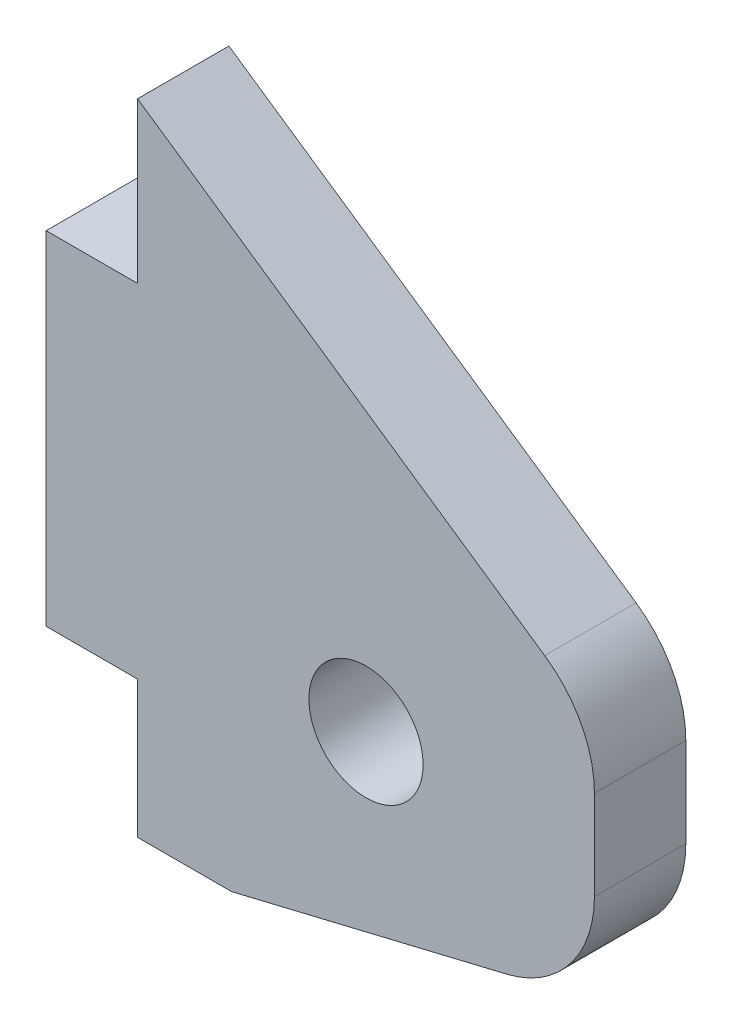
ISO-10303-21;
HEADER;
FILE_DESCRIPTION(('STEP AP214'),'2;1');
FILE_NAME('part.step','',(''),(''),'','','');
FILE_SCHEMA(('AUTOMOTIVE_DESIGN { 1 0 10303 214 1 1 1 1 }'));
ENDSEC;
DATA;
#1=APPLICATION_CONTEXT('core data for automotive mechanical design processes');
#2=APPLICATION_PROTOCOL_DEFINITION('international standard','automotive_design',2000,#1);
#3=PRODUCT_CONTEXT('',#1,'mechanical');
#4=PRODUCT('Part','Part','',(#3));
#5=PRODUCT_RELATED_PRODUCT_CATEGORY('part','',(#4));
#6=PRODUCT_DEFINITION_FORMATION('','',#4);
#7=PRODUCT_DEFINITION_CONTEXT('part definition',#1,'design');
#8=PRODUCT_DEFINITION('design','',#6,#7);
#9=PRODUCT_DEFINITION_SHAPE('','',#8);
#10=(LENGTH_UNIT() NAMED_UNIT(*) SI_UNIT(.MILLI.,.METRE.));
#11=(NAMED_UNIT(*) PLANE_ANGLE_UNIT() SI_UNIT($,.RADIAN.));
#12=(NAMED_UNIT(*) SI_UNIT($,.STERADIAN.) SOLID_ANGLE_UNIT());
#13=UNCERTAINTY_MEASURE_WITH_UNIT(LENGTH_MEASURE(1.E-05),#10,'distance_accuracy_value','');
#14=(GEOMETRIC_REPRESENTATION_CONTEXT(3) GLOBAL_UNCERTAINTY_ASSIGNED_CONTEXT((#13)) GLOBAL_UNIT_ASSIGNED_CONTEXT((#10,
#11,#12)) REPRESENTATION_CONTEXT('',''));
#15=CARTESIAN_POINT('',(0.,0.,0.));
#16=DIRECTION('',(0.,0.,1.));
#17=DIRECTION('',(1.,0.,0.));
#18=AXIS2_PLACEMENT_3D('',#15,#16,#17);
#19=CARTESIAN_POINT('',(24.,0.,4.));
#20=DIRECTION('',(1.,0.,0.));
#21=DIRECTION('',(0.,1.,0.));
#22=AXIS2_PLACEMENT_3D('',#19,#20,#21);
#23=PLANE('',#22);
#24=DIRECTION('',(0.,-1.,0.));
#25=VECTOR('',#24,1.);
#26=CARTESIAN_POINT('',(24.,0.,0.));
#27=LINE('',#26,#25);
#28=CARTESIAN_POINT('',(24.,5.67545218373454,0.));
#29=VERTEX_POINT('',#28);
#30=CARTESIAN_POINT('',(24.,1.75794758941488,0.));
#31=VERTEX_POINT('',#30);
#32=EDGE_CURVE('E183',#29,#31,#27,.T.);
#33=ORIENTED_EDGE('',*,*,#32,.F.);
#34=DIRECTION('',(0.,0.,-1.));
#35=VECTOR('',#34,1.);
#36=CARTESIAN_POINT('',(24.,5.67545218373454,4.));
#37=LINE('',#36,#35);
#38=CARTESIAN_POINT('',(24.,5.67545218373454,4.));
#39=VERTEX_POINT('',#38);
#40=EDGE_CURVE('E244',#29,#39,#37,.F.);
#41=ORIENTED_EDGE('',*,*,#40,.T.);
#42=DIRECTION('',(0.,-1.,0.));
#43=VECTOR('',#42,1.);
#44=CARTESIAN_POINT('',(24.,0.,4.));
#45=LINE('',#44,#43);
#46=CARTESIAN_POINT('',(24.,1.75794758941488,4.));
#47=VERTEX_POINT('',#46);
#48=EDGE_CURVE('E149',#39,#47,#45,.T.);
#49=ORIENTED_EDGE('',*,*,#48,.T.);
#50=DIRECTION('',(0.,0.,-1.));
#51=VECTOR('',#50,1.);
#52=CARTESIAN_POINT('',(24.,1.75794758941488,0.));
#53=LINE('',#52,#51);
#54=EDGE_CURVE('E240',#47,#31,#53,.T.);
#55=ORIENTED_EDGE('',*,*,#54,.T.);
#56=EDGE_LOOP('',(#33,#41,#49,#55));
#57=FACE_BOUND('',#56,.T.);
#58=ADVANCED_FACE('F41',(#57),#23,.T.);
#59=CARTESIAN_POINT('',(11.5296606336198,16.8468425845098,4.));
#60=DIRECTION('',(0.56477979013995,0.825241654698473,0.));
#61=DIRECTION('',(-0.825241654698473,0.56477979013995,0.));
#62=AXIS2_PLACEMENT_3D('',#59,#60,#61);
#63=PLANE('',#62);
#64=DIRECTION('',(0.825241654698473,-0.56477979013995,0.));
#65=VECTOR('',#64,1.);
#66=CARTESIAN_POINT('',(11.5296606336198,16.8468425845098,4.));
#67=LINE('',#66,#65);
#68=CARTESIAN_POINT('',(4.,22.,4.));
#69=VERTEX_POINT('',#68);
#70=CARTESIAN_POINT('',(21.8238989506998,9.80166045722691,4.));
#71=VERTEX_POINT('',#70);
#72=EDGE_CURVE('E130',#69,#71,#67,.T.);
#73=ORIENTED_EDGE('',*,*,#72,.T.);
#74=DIRECTION('',(0.,0.,-1.));
#75=VECTOR('',#74,1.);
#76=CARTESIAN_POINT('',(21.8238989506998,9.80166045722691,4.));
#77=LINE('',#76,#75);
#78=CARTESIAN_POINT('',(21.8238989506998,9.80166045722691,0.));
#79=VERTEX_POINT('',#78);
#80=EDGE_CURVE('E139',#71,#79,#77,.T.);
#81=ORIENTED_EDGE('',*,*,#80,.T.);
#82=DIRECTION('',(0.825241654698473,-0.56477979013995,0.));
#83=VECTOR('',#82,1.);
#84=CARTESIAN_POINT('',(11.5296606336198,16.8468425845098,0.));
#85=LINE('',#84,#83);
#86=CARTESIAN_POINT('',(4.,22.,0.));
#87=VERTEX_POINT('',#86);
#88=EDGE_CURVE('E133',#87,#79,#85,.T.);
#89=ORIENTED_EDGE('',*,*,#88,.F.);
#90=DIRECTION('',(0.,0.,-1.));
#91=VECTOR('',#90,1.);
#92=CARTESIAN_POINT('',(4.,22.,4.));
#93=LINE('',#92,#91);
#94=EDGE_CURVE('E126',#69,#87,#93,.T.);
#95=ORIENTED_EDGE('',*,*,#94,.F.);
#96=EDGE_LOOP('',(#73,#81,#89,#95));
#97=FACE_BOUND('',#96,.T.);
#98=ADVANCED_FACE('F128',(#97),#63,.T.);
#99=CARTESIAN_POINT('',(4.,0.,4.));
#100=DIRECTION('',(-1.,0.,0.));
#101=DIRECTION('',(0.,0.,1.));
#102=AXIS2_PLACEMENT_3D('',#99,#100,#101);
#103=PLANE('',#102);
#104=DIRECTION('',(0.,1.,0.));
#105=VECTOR('',#104,1.);
#106=CARTESIAN_POINT('',(4.,0.,0.));
#107=LINE('',#106,#105);
#108=CARTESIAN_POINT('',(4.,15.,0.));
#109=VERTEX_POINT('',#108);
#110=EDGE_CURVE('E189',#109,#87,#107,.T.);
#111=ORIENTED_EDGE('',*,*,#110,.F.);
#112=DIRECTION('',(0.,0.,-1.));
#113=VECTOR('',#112,1.);
#114=CARTESIAN_POINT('',(4.,15.,4.));
#115=LINE('',#114,#113);
#116=CARTESIAN_POINT('',(4.,15.,4.));
#117=VERTEX_POINT('',#116);
#118=EDGE_CURVE('E140',#117,#109,#115,.T.);
#119=ORIENTED_EDGE('',*,*,#118,.F.);
#120=DIRECTION('',(0.,1.,0.));
#121=VECTOR('',#120,1.);
#122=CARTESIAN_POINT('',(4.,0.,4.));
#123=LINE('',#122,#121);
#124=EDGE_CURVE('E145',#117,#69,#123,.T.);
#125=ORIENTED_EDGE('',*,*,#124,.T.);
#126=ORIENTED_EDGE('',*,*,#94,.T.);
#127=EDGE_LOOP('',(#111,#119,#125,#126));
#128=FACE_BOUND('',#127,.T.);
#129=ADVANCED_FACE('F151',(#128),#103,.T.);
#130=CARTESIAN_POINT('',(0.,15.,4.));
#131=DIRECTION('',(0.,1.,0.));
#132=DIRECTION('',(0.,0.,1.));
#133=AXIS2_PLACEMENT_3D('',#130,#131,#132);
#134=PLANE('',#133);
#135=DIRECTION('',(1.,0.,0.));
#136=VECTOR('',#135,1.);
#137=CARTESIAN_POINT('',(0.,15.,0.));
#138=LINE('',#137,#136);
#139=CARTESIAN_POINT('',(0.,15.,0.));
#140=VERTEX_POINT('',#139);
#141=EDGE_CURVE('E192',#140,#109,#138,.T.);
#142=ORIENTED_EDGE('',*,*,#141,.F.);
#143=DIRECTION('',(0.,0.,-1.));
#144=VECTOR('',#143,1.);
#145=CARTESIAN_POINT('',(0.,15.,4.));
#146=LINE('',#145,#144);
#147=CARTESIAN_POINT('',(0.,15.,4.));
#148=VERTEX_POINT('',#147);
#149=EDGE_CURVE('E227',#148,#140,#146,.T.);
#150=ORIENTED_EDGE('',*,*,#149,.F.);
#151=DIRECTION('',(1.,0.,0.));
#152=VECTOR('',#151,1.);
#153=CARTESIAN_POINT('',(0.,15.,4.));
#154=LINE('',#153,#152);
#155=EDGE_CURVE('E153',#148,#117,#154,.T.);
#156=ORIENTED_EDGE('',*,*,#155,.T.);
#157=ORIENTED_EDGE('',*,*,#118,.T.);
#158=EDGE_LOOP('',(#142,#150,#156,#157));
#159=FACE_BOUND('',#158,.T.);
#160=ADVANCED_FACE('F261',(#159),#134,.T.);
#161=CARTESIAN_POINT('',(0.,0.,4.));
#162=DIRECTION('',(-1.,0.,0.));
#163=DIRECTION('',(0.,0.,1.));
#164=AXIS2_PLACEMENT_3D('',#161,#162,#163);
#165=PLANE('',#164);
#166=DIRECTION('',(0.,1.,0.));
#167=VECTOR('',#166,1.);
#168=CARTESIAN_POINT('',(0.,0.,0.));
#169=LINE('',#168,#167);
#170=CARTESIAN_POINT('',(0.,0.,0.));
#171=VERTEX_POINT('',#170);
#172=EDGE_CURVE('E196',#171,#140,#169,.T.);
#173=ORIENTED_EDGE('',*,*,#172,.F.);
#174=DIRECTION('',(0.,0.,-1.));
#175=VECTOR('',#174,1.);
#176=CARTESIAN_POINT('',(0.,0.,4.));
#177=LINE('',#176,#175);
#178=CARTESIAN_POINT('',(0.,0.,4.));
#179=VERTEX_POINT('',#178);
#180=EDGE_CURVE('E224',#179,#171,#177,.T.);
#181=ORIENTED_EDGE('',*,*,#180,.F.);
#182=DIRECTION('',(0.,1.,0.));
#183=VECTOR('',#182,1.);
#184=CARTESIAN_POINT('',(0.,0.,4.));
#185=LINE('',#184,#183);
#186=EDGE_CURVE('E156',#179,#148,#185,.T.);
#187=ORIENTED_EDGE('',*,*,#186,.T.);
#188=ORIENTED_EDGE('',*,*,#149,.T.);
#189=EDGE_LOOP('',(#173,#181,#187,#188));
#190=FACE_BOUND('',#189,.T.);
#191=ADVANCED_FACE('F265',(#190),#165,.T.);
#192=CARTESIAN_POINT('',(0.,0.,4.));
#193=DIRECTION('',(0.,-1.,0.));
#194=DIRECTION('',(1.,0.,0.));
#195=AXIS2_PLACEMENT_3D('',#192,#193,#194);
#196=PLANE('',#195);
#197=DIRECTION('',(-1.,0.,0.));
#198=VECTOR('',#197,1.);
#199=CARTESIAN_POINT('',(0.,0.,0.));
#200=LINE('',#199,#198);
#201=CARTESIAN_POINT('',(4.,0.,0.));
#202=VERTEX_POINT('',#201);
#203=EDGE_CURVE('E200',#202,#171,#200,.T.);
#204=ORIENTED_EDGE('',*,*,#203,.F.);
#205=DIRECTION('',(0.,0.,-1.));
#206=VECTOR('',#205,1.);
#207=CARTESIAN_POINT('',(4.,0.,4.));
#208=LINE('',#207,#206);
#209=CARTESIAN_POINT('',(4.,0.,4.));
#210=VERTEX_POINT('',#209);
#211=EDGE_CURVE('E221',#210,#202,#208,.T.);
#212=ORIENTED_EDGE('',*,*,#211,.F.);
#213=DIRECTION('',(-1.,0.,0.));
#214=VECTOR('',#213,1.);
#215=CARTESIAN_POINT('',(0.,0.,4.));
#216=LINE('',#215,#214);
#217=EDGE_CURVE('E163',#210,#179,#216,.T.);
#218=ORIENTED_EDGE('',*,*,#217,.T.);
#219=ORIENTED_EDGE('',*,*,#180,.T.);
#220=EDGE_LOOP('',(#204,#212,#218,#219));
#221=FACE_BOUND('',#220,.T.);
#222=ADVANCED_FACE('F268',(#221),#196,.T.);
#223=CARTESIAN_POINT('',(4.,0.,4.));
#224=DIRECTION('',(-1.,0.,0.));
#225=DIRECTION('',(0.,0.,1.));
#226=AXIS2_PLACEMENT_3D('',#223,#224,#225);
#227=PLANE('',#226);
#228=DIRECTION('',(0.,1.,0.));
#229=VECTOR('',#228,1.);
#230=CARTESIAN_POINT('',(4.,0.,0.));
#231=LINE('',#230,#229);
#232=CARTESIAN_POINT('',(4.,-6.,0.));
#233=VERTEX_POINT('',#232);
#234=EDGE_CURVE('E204',#233,#202,#231,.T.);
#235=ORIENTED_EDGE('',*,*,#234,.F.);
#236=DIRECTION('',(0.,0.,-1.));
#237=VECTOR('',#236,1.);
#238=CARTESIAN_POINT('',(4.,-6.,4.));
#239=LINE('',#238,#237);
#240=CARTESIAN_POINT('',(4.,-6.,4.));
#241=VERTEX_POINT('',#240);
#242=EDGE_CURVE('E218',#241,#233,#239,.T.);
#243=ORIENTED_EDGE('',*,*,#242,.F.);
#244=DIRECTION('',(0.,1.,0.));
#245=VECTOR('',#244,1.);
#246=CARTESIAN_POINT('',(4.,0.,4.));
#247=LINE('',#246,#245);
#248=EDGE_CURVE('E167',#241,#210,#247,.T.);
#249=ORIENTED_EDGE('',*,*,#248,.T.);
#250=ORIENTED_EDGE('',*,*,#211,.T.);
#251=EDGE_LOOP('',(#235,#243,#249,#250));
#252=FACE_BOUND('',#251,.T.);
#253=ADVANCED_FACE('F273',(#252),#227,.T.);
#254=CARTESIAN_POINT('',(0.,-6.,4.));
#255=DIRECTION('',(0.,-1.,0.));
#256=DIRECTION('',(1.,0.,0.));
#257=AXIS2_PLACEMENT_3D('',#254,#255,#256);
#258=PLANE('',#257);
#259=DIRECTION('',(-1.,0.,0.));
#260=VECTOR('',#259,1.);
#261=CARTESIAN_POINT('',(0.,-6.,0.));
#262=LINE('',#261,#260);
#263=CARTESIAN_POINT('',(8.11076380065098,-6.,0.));
#264=VERTEX_POINT('',#263);
#265=EDGE_CURVE('E208',#264,#233,#262,.T.);
#266=ORIENTED_EDGE('',*,*,#265,.F.);
#267=DIRECTION('',(0.,0.,-1.));
#268=VECTOR('',#267,1.);
#269=CARTESIAN_POINT('',(8.11076380065098,-6.,4.));
#270=LINE('',#269,#268);
#271=CARTESIAN_POINT('',(8.11076380065098,-6.,4.));
#272=VERTEX_POINT('',#271);
#273=EDGE_CURVE('E178',#272,#264,#270,.T.);
#274=ORIENTED_EDGE('',*,*,#273,.F.);
#275=DIRECTION('',(-1.,0.,0.));
#276=VECTOR('',#275,1.);
#277=CARTESIAN_POINT('',(0.,-6.,4.));
#278=LINE('',#277,#276);
#279=EDGE_CURVE('E171',#272,#241,#278,.T.);
#280=ORIENTED_EDGE('',*,*,#279,.T.);
#281=ORIENTED_EDGE('',*,*,#242,.T.);
#282=EDGE_LOOP('',(#266,#274,#280,#281));
#283=FACE_BOUND('',#282,.T.);
#284=ADVANCED_FACE('F276',(#283),#258,.T.);
#285=CARTESIAN_POINT('',(14.,3.,4.));
#286=DIRECTION('',(0.,0.,-1.));
#287=DIRECTION('',(-1.,0.,0.));
#288=AXIS2_PLACEMENT_3D('',#285,#286,#287);
#289=CYLINDRICAL_SURFACE('',#288,2.5);
#290=CARTESIAN_POINT('',(14.,3.,4.));
#291=DIRECTION('',(0.,0.,1.));
#292=DIRECTION('',(1.,0.,0.));
#293=AXIS2_PLACEMENT_3D('',#290,#291,#292);
#294=CIRCLE('',#293,2.5);
#295=CARTESIAN_POINT('',(16.5,3.,4.));
#296=VERTEX_POINT('',#295);
#297=EDGE_CURVE('E215',#296,#296,#294,.T.);
#298=ORIENTED_EDGE('',*,*,#297,.T.);
#299=EDGE_LOOP('',(#298));
#300=FACE_BOUND('',#299,.T.);
#301=CARTESIAN_POINT('',(14.,3.,0.));
#302=DIRECTION('',(0.,0.,1.));
#303=DIRECTION('',(1.,0.,0.));
#304=AXIS2_PLACEMENT_3D('',#301,#302,#303);
#305=CIRCLE('',#304,2.5);
#306=CARTESIAN_POINT('',(16.5,3.,0.));
#307=VERTEX_POINT('',#306);
#308=EDGE_CURVE('E179',#307,#307,#305,.T.);
#309=ORIENTED_EDGE('',*,*,#308,.F.);
#310=EDGE_LOOP('',(#309));
#311=FACE_BOUND('',#310,.T.);
#312=ADVANCED_FACE('F281',(#300,#311),#289,.F.);
#313=CARTESIAN_POINT('',(1.80511260454205,-7.51468830086219,4.));
#314=DIRECTION('',(-0.233567159699266,0.972340671734973,0.));
#315=DIRECTION('',(-0.972340671734973,-0.233567159699266,0.));
#316=AXIS2_PLACEMENT_3D('',#313,#314,#315);
#317=PLANE('',#316);
#318=DIRECTION('',(0.972340671734973,0.233567159699266,0.));
#319=VECTOR('',#318,1.);
#320=CARTESIAN_POINT('',(1.80511260454205,-7.51468830086219,0.));
#321=LINE('',#320,#319);
#322=CARTESIAN_POINT('',(20.1678357984963,-3.10375576925998,0.));
#323=VERTEX_POINT('',#322);
#324=EDGE_CURVE('E212',#264,#323,#321,.T.);
#325=ORIENTED_EDGE('',*,*,#324,.T.);
#326=DIRECTION('',(0.,0.,-1.));
#327=VECTOR('',#326,1.);
#328=CARTESIAN_POINT('',(20.1678357984963,-3.10375576925998,4.));
#329=LINE('',#328,#327);
#330=CARTESIAN_POINT('',(20.1678357984963,-3.10375576925998,4.));
#331=VERTEX_POINT('',#330);
#332=EDGE_CURVE('E11',#323,#331,#329,.F.);
#333=ORIENTED_EDGE('',*,*,#332,.T.);
#334=DIRECTION('',(0.972340671734973,0.233567159699266,0.));
#335=VECTOR('',#334,1.);
#336=CARTESIAN_POINT('',(1.80511260454205,-7.51468830086219,4.));
#337=LINE('',#336,#335);
#338=EDGE_CURVE('E175',#272,#331,#337,.T.);
#339=ORIENTED_EDGE('',*,*,#338,.F.);
#340=ORIENTED_EDGE('',*,*,#273,.T.);
#341=EDGE_LOOP('',(#325,#333,#339,#340));
#342=FACE_BOUND('',#341,.T.);
#343=ADVANCED_FACE('F279',(#342),#317,.F.);
#344=CARTESIAN_POINT('',(0.,0.,4.));
#345=DIRECTION('',(0.,0.,1.));
#346=DIRECTION('',(1.,0.,0.));
#347=AXIS2_PLACEMENT_3D('',#344,#345,#346);
#348=PLANE('',#347);
#349=ORIENTED_EDGE('',*,*,#297,.F.);
#350=EDGE_LOOP('',(#349));
#351=FACE_BOUND('',#350,.T.);
#352=ORIENTED_EDGE('',*,*,#48,.F.);
#353=CARTESIAN_POINT('',(19.,5.67545218373454,4.));
#354=DIRECTION('',(0.,0.,1.));
#355=DIRECTION('',(1.,0.,0.));
#356=AXIS2_PLACEMENT_3D('',#353,#354,#355);
#357=CIRCLE('',#356,5.);
#358=EDGE_CURVE('E50',#39,#71,#357,.T.);
#359=ORIENTED_EDGE('',*,*,#358,.T.);
#360=ORIENTED_EDGE('',*,*,#72,.F.);
#361=ORIENTED_EDGE('',*,*,#124,.F.);
#362=ORIENTED_EDGE('',*,*,#155,.F.);
#363=ORIENTED_EDGE('',*,*,#186,.F.);
#364=ORIENTED_EDGE('',*,*,#217,.F.);
#365=ORIENTED_EDGE('',*,*,#248,.F.);
#366=ORIENTED_EDGE('',*,*,#279,.F.);
#367=ORIENTED_EDGE('',*,*,#338,.T.);
#368=CARTESIAN_POINT('',(19.,1.75794758941488,4.));
#369=DIRECTION('',(0.,0.,1.));
#370=DIRECTION('',(1.,0.,0.));
#371=AXIS2_PLACEMENT_3D('',#368,#369,#370);
#372=CIRCLE('',#371,5.);
#373=EDGE_CURVE('E62',#331,#47,#372,.T.);
#374=ORIENTED_EDGE('',*,*,#373,.T.);
#375=EDGE_LOOP('',(#352,#359,#360,#361,#362,#363,#364,#365,#366,#367,#374));
#376=FACE_BOUND('',#375,.T.);
#377=ADVANCED_FACE('F143',(#351,#376),#348,.T.);
#378=CARTESIAN_POINT('',(0.,0.,0.));
#379=DIRECTION('',(0.,0.,1.));
#380=DIRECTION('',(1.,0.,0.));
#381=AXIS2_PLACEMENT_3D('',#378,#379,#380);
#382=PLANE('',#381);
#383=ORIENTED_EDGE('',*,*,#308,.T.);
#384=EDGE_LOOP('',(#383));
#385=FACE_BOUND('',#384,.T.);
#386=ORIENTED_EDGE('',*,*,#88,.T.);
#387=CARTESIAN_POINT('',(19.,5.67545218373454,0.));
#388=DIRECTION('',(0.,0.,1.));
#389=DIRECTION('',(1.,0.,0.));
#390=AXIS2_PLACEMENT_3D('',#387,#388,#389);
#391=CIRCLE('',#390,5.);
#392=EDGE_CURVE('E237',#79,#29,#391,.F.);
#393=ORIENTED_EDGE('',*,*,#392,.T.);
#394=ORIENTED_EDGE('',*,*,#32,.T.);
#395=CARTESIAN_POINT('',(19.,1.75794758941488,0.));
#396=DIRECTION('',(0.,0.,1.));
#397=DIRECTION('',(1.,0.,0.));
#398=AXIS2_PLACEMENT_3D('',#395,#396,#397);
#399=CIRCLE('',#398,5.);
#400=EDGE_CURVE('E234',#31,#323,#399,.F.);
#401=ORIENTED_EDGE('',*,*,#400,.T.);
#402=ORIENTED_EDGE('',*,*,#324,.F.);
#403=ORIENTED_EDGE('',*,*,#265,.T.);
#404=ORIENTED_EDGE('',*,*,#234,.T.);
#405=ORIENTED_EDGE('',*,*,#203,.T.);
#406=ORIENTED_EDGE('',*,*,#172,.T.);
#407=ORIENTED_EDGE('',*,*,#141,.T.);
#408=ORIENTED_EDGE('',*,*,#110,.T.);
#409=EDGE_LOOP('',(#386,#393,#394,#401,#402,#403,#404,#405,#406,#407,#408));
#410=FACE_BOUND('',#409,.T.);
#411=ADVANCED_FACE('F257',(#385,#410),#382,.F.);
#412=CARTESIAN_POINT('',(19.,5.67545218373454,4.));
#413=DIRECTION('',(0.,0.,-1.));
#414=DIRECTION('',(-1.,0.,0.));
#415=AXIS2_PLACEMENT_3D('',#412,#413,#414);
#416=CYLINDRICAL_SURFACE('',#415,5.);
#417=ORIENTED_EDGE('',*,*,#358,.F.);
#418=ORIENTED_EDGE('',*,*,#40,.F.);
#419=ORIENTED_EDGE('',*,*,#392,.F.);
#420=ORIENTED_EDGE('',*,*,#80,.F.);
#421=EDGE_LOOP('',(#417,#418,#419,#420));
#422=FACE_BOUND('',#421,.T.);
#423=ADVANCED_FACE('F255',(#422),#416,.T.);
#424=CARTESIAN_POINT('',(19.,1.75794758941488,4.));
#425=DIRECTION('',(0.,0.,1.));
#426=DIRECTION('',(1.,0.,0.));
#427=AXIS2_PLACEMENT_3D('',#424,#425,#426);
#428=CYLINDRICAL_SURFACE('',#427,5.);
#429=ORIENTED_EDGE('',*,*,#373,.F.);
#430=ORIENTED_EDGE('',*,*,#332,.F.);
#431=ORIENTED_EDGE('',*,*,#400,.F.);
#432=ORIENTED_EDGE('',*,*,#54,.F.);
#433=EDGE_LOOP('',(#429,#430,#431,#432));
#434=FACE_BOUND('',#433,.T.);
#435=ADVANCED_FACE('F43',(#434),#428,.T.);
#436=CLOSED_SHELL('',(#58,#98,#129,#160,#191,#222,#253,#284,#312,#343,#377,#411,#423,#435));
#437=MANIFOLD_SOLID_BREP('B2',#436);
#438=ADVANCED_BREP_SHAPE_REPRESENTATION('',(#18,#437),#14);
#439=SHAPE_DEFINITION_REPRESENTATION(#9,#438);
ENDSEC;
END-ISO-10303-21;
